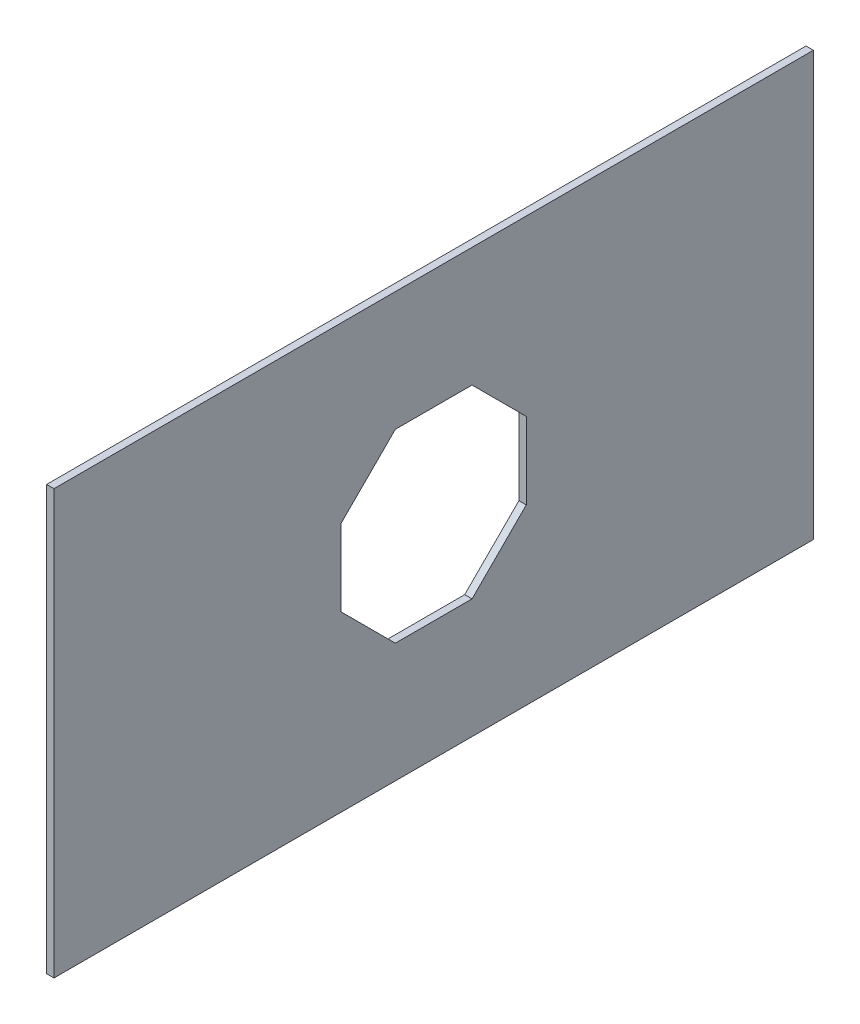
ISO-10303-21;
HEADER;
FILE_DESCRIPTION(('STEP AP214'),'2;1');
FILE_NAME('part.step','',(''),(''),'','','');
FILE_SCHEMA(('AUTOMOTIVE_DESIGN { 1 0 10303 214 1 1 1 1 }'));
ENDSEC;
DATA;
#1=APPLICATION_CONTEXT('core data for automotive mechanical design processes');
#2=APPLICATION_PROTOCOL_DEFINITION('international standard','automotive_design',2000,#1);
#3=PRODUCT_CONTEXT('',#1,'mechanical');
#4=PRODUCT('Part','Part','',(#3));
#5=PRODUCT_RELATED_PRODUCT_CATEGORY('part','',(#4));
#6=PRODUCT_DEFINITION_FORMATION('','',#4);
#7=PRODUCT_DEFINITION_CONTEXT('part definition',#1,'design');
#8=PRODUCT_DEFINITION('design','',#6,#7);
#9=PRODUCT_DEFINITION_SHAPE('','',#8);
#10=(LENGTH_UNIT() NAMED_UNIT(*) SI_UNIT(.MILLI.,.METRE.));
#11=(NAMED_UNIT(*) PLANE_ANGLE_UNIT() SI_UNIT($,.RADIAN.));
#12=(NAMED_UNIT(*) SI_UNIT($,.STERADIAN.) SOLID_ANGLE_UNIT());
#13=UNCERTAINTY_MEASURE_WITH_UNIT(LENGTH_MEASURE(1.E-05),#10,'distance_accuracy_value','');
#14=(GEOMETRIC_REPRESENTATION_CONTEXT(3) GLOBAL_UNCERTAINTY_ASSIGNED_CONTEXT((#13)) GLOBAL_UNIT_ASSIGNED_CONTEXT((#10,
#11,#12)) REPRESENTATION_CONTEXT('',''));
#15=CARTESIAN_POINT('',(0.,0.,0.));
#16=DIRECTION('',(0.,0.,1.));
#17=DIRECTION('',(1.,0.,0.));
#18=AXIS2_PLACEMENT_3D('',#15,#16,#17);
#19=CARTESIAN_POINT('',(4.7625,-137.31875,-246.0625));
#20=DIRECTION('',(0.,0.,1.));
#21=DIRECTION('',(1.,0.,0.));
#22=AXIS2_PLACEMENT_3D('',#19,#20,#21);
#23=PLANE('',#22);
#24=DIRECTION('',(0.,1.,0.));
#25=VECTOR('',#24,1.);
#26=CARTESIAN_POINT('',(0.,-137.31875,-246.0625));
#27=LINE('',#26,#25);
#28=CARTESIAN_POINT('',(0.,-137.31875,-246.0625));
#29=VERTEX_POINT('',#28);
#30=CARTESIAN_POINT('',(0.,137.31875,-246.0625));
#31=VERTEX_POINT('',#30);
#32=EDGE_CURVE('E127',#29,#31,#27,.T.);
#33=ORIENTED_EDGE('',*,*,#32,.T.);
#34=DIRECTION('',(-1.,0.,0.));
#35=VECTOR('',#34,1.);
#36=CARTESIAN_POINT('',(4.7625,137.31875,-246.0625));
#37=LINE('',#36,#35);
#38=CARTESIAN_POINT('',(4.7625,137.31875,-246.0625));
#39=VERTEX_POINT('',#38);
#40=EDGE_CURVE('E11',#39,#31,#37,.T.);
#41=ORIENTED_EDGE('',*,*,#40,.F.);
#42=DIRECTION('',(0.,1.,0.));
#43=VECTOR('',#42,1.);
#44=CARTESIAN_POINT('',(4.7625,-137.31875,-246.0625));
#45=LINE('',#44,#43);
#46=CARTESIAN_POINT('',(4.7625,-137.31875,-246.0625));
#47=VERTEX_POINT('',#46);
#48=EDGE_CURVE('E177',#47,#39,#45,.T.);
#49=ORIENTED_EDGE('',*,*,#48,.F.);
#50=DIRECTION('',(-1.,0.,0.));
#51=VECTOR('',#50,1.);
#52=CARTESIAN_POINT('',(4.7625,-137.31875,-246.0625));
#53=LINE('',#52,#51);
#54=EDGE_CURVE('E187',#47,#29,#53,.T.);
#55=ORIENTED_EDGE('',*,*,#54,.T.);
#56=EDGE_LOOP('',(#33,#41,#49,#55));
#57=FACE_BOUND('',#56,.T.);
#58=ADVANCED_FACE('F33',(#57),#23,.F.);
#59=CARTESIAN_POINT('',(4.7625,137.31875,246.0625));
#60=DIRECTION('',(0.,-1.,0.));
#61=DIRECTION('',(0.,0.,-1.));
#62=AXIS2_PLACEMENT_3D('',#59,#60,#61);
#63=PLANE('',#62);
#64=DIRECTION('',(0.,0.,1.));
#65=VECTOR('',#64,1.);
#66=CARTESIAN_POINT('',(0.,137.31875,246.0625));
#67=LINE('',#66,#65);
#68=CARTESIAN_POINT('',(0.,137.31875,246.0625));
#69=VERTEX_POINT('',#68);
#70=EDGE_CURVE('E190',#31,#69,#67,.T.);
#71=ORIENTED_EDGE('',*,*,#70,.T.);
#72=DIRECTION('',(-1.,0.,0.));
#73=VECTOR('',#72,1.);
#74=CARTESIAN_POINT('',(4.7625,137.31875,246.0625));
#75=LINE('',#74,#73);
#76=CARTESIAN_POINT('',(4.7625,137.31875,246.0625));
#77=VERTEX_POINT('',#76);
#78=EDGE_CURVE('E40',#77,#69,#75,.T.);
#79=ORIENTED_EDGE('',*,*,#78,.F.);
#80=DIRECTION('',(0.,0.,1.));
#81=VECTOR('',#80,1.);
#82=CARTESIAN_POINT('',(4.7625,137.31875,246.0625));
#83=LINE('',#82,#81);
#84=EDGE_CURVE('E180',#39,#77,#83,.T.);
#85=ORIENTED_EDGE('',*,*,#84,.F.);
#86=ORIENTED_EDGE('',*,*,#40,.T.);
#87=EDGE_LOOP('',(#71,#79,#85,#86));
#88=FACE_BOUND('',#87,.T.);
#89=ADVANCED_FACE('F218',(#88),#63,.F.);
#90=CARTESIAN_POINT('',(4.7625,-137.31875,246.0625));
#91=DIRECTION('',(0.,0.,-1.));
#92=DIRECTION('',(-1.,0.,0.));
#93=AXIS2_PLACEMENT_3D('',#90,#91,#92);
#94=PLANE('',#93);
#95=DIRECTION('',(0.,-1.,0.));
#96=VECTOR('',#95,1.);
#97=CARTESIAN_POINT('',(0.,-137.31875,246.0625));
#98=LINE('',#97,#96);
#99=CARTESIAN_POINT('',(0.,-137.31875,246.0625));
#100=VERTEX_POINT('',#99);
#101=EDGE_CURVE('E192',#69,#100,#98,.T.);
#102=ORIENTED_EDGE('',*,*,#101,.T.);
#103=DIRECTION('',(-1.,0.,0.));
#104=VECTOR('',#103,1.);
#105=CARTESIAN_POINT('',(4.7625,-137.31875,246.0625));
#106=LINE('',#105,#104);
#107=CARTESIAN_POINT('',(4.7625,-137.31875,246.0625));
#108=VERTEX_POINT('',#107);
#109=EDGE_CURVE('E197',#108,#100,#106,.T.);
#110=ORIENTED_EDGE('',*,*,#109,.F.);
#111=DIRECTION('',(0.,-1.,0.));
#112=VECTOR('',#111,1.);
#113=CARTESIAN_POINT('',(4.7625,-137.31875,246.0625));
#114=LINE('',#113,#112);
#115=EDGE_CURVE('E183',#77,#108,#114,.T.);
#116=ORIENTED_EDGE('',*,*,#115,.F.);
#117=ORIENTED_EDGE('',*,*,#78,.T.);
#118=EDGE_LOOP('',(#102,#110,#116,#117));
#119=FACE_BOUND('',#118,.T.);
#120=ADVANCED_FACE('F204',(#119),#94,.F.);
#121=CARTESIAN_POINT('',(4.7625,-137.31875,246.0625));
#122=DIRECTION('',(0.,1.,0.));
#123=DIRECTION('',(0.,0.,1.));
#124=AXIS2_PLACEMENT_3D('',#121,#122,#123);
#125=PLANE('',#124);
#126=DIRECTION('',(0.,0.,-1.));
#127=VECTOR('',#126,1.);
#128=CARTESIAN_POINT('',(0.,-137.31875,246.0625));
#129=LINE('',#128,#127);
#130=EDGE_CURVE('E181',#100,#29,#129,.T.);
#131=ORIENTED_EDGE('',*,*,#130,.T.);
#132=ORIENTED_EDGE('',*,*,#54,.F.);
#133=DIRECTION('',(0.,0.,-1.));
#134=VECTOR('',#133,1.);
#135=CARTESIAN_POINT('',(4.7625,-137.31875,246.0625));
#136=LINE('',#135,#134);
#137=EDGE_CURVE('E185',#108,#47,#136,.T.);
#138=ORIENTED_EDGE('',*,*,#137,.F.);
#139=ORIENTED_EDGE('',*,*,#109,.T.);
#140=EDGE_LOOP('',(#131,#132,#138,#139));
#141=FACE_BOUND('',#140,.T.);
#142=ADVANCED_FACE('F211',(#141),#125,.F.);
#143=CARTESIAN_POINT('',(4.7625,0.,0.));
#144=DIRECTION('',(-1.,0.,0.));
#145=DIRECTION('',(0.,0.,1.));
#146=AXIS2_PLACEMENT_3D('',#143,#144,#145);
#147=PLANE('',#146);
#148=DIRECTION('',(0.,0.707106781186546,-0.707106781186549));
#149=VECTOR('',#148,1.);
#150=CARTESIAN_POINT('',(4.7625,-42.4264068711929,-42.4264068711928));
#151=LINE('',#150,#149);
#152=CARTESIAN_POINT('',(4.7625,-60.,-24.8528137423857));
#153=VERTEX_POINT('',#152);
#154=CARTESIAN_POINT('',(4.7625,-24.8528137423858,-60.));
#155=VERTEX_POINT('',#154);
#156=EDGE_CURVE('E139',#153,#155,#151,.T.);
#157=ORIENTED_EDGE('',*,*,#156,.F.);
#158=DIRECTION('',(0.,0.,-1.));
#159=VECTOR('',#158,1.);
#160=CARTESIAN_POINT('',(4.7625,-60.,24.8528137423857));
#161=LINE('',#160,#159);
#162=CARTESIAN_POINT('',(4.7625,-60.,24.8528137423857));
#163=VERTEX_POINT('',#162);
#164=EDGE_CURVE('E47',#163,#153,#161,.T.);
#165=ORIENTED_EDGE('',*,*,#164,.F.);
#166=DIRECTION('',(0.,-0.707106781186546,-0.707106781186549));
#167=VECTOR('',#166,1.);
#168=CARTESIAN_POINT('',(4.7625,-24.8528137423858,60.));
#169=LINE('',#168,#167);
#170=CARTESIAN_POINT('',(4.7625,-24.8528137423858,60.));
#171=VERTEX_POINT('',#170);
#172=EDGE_CURVE('E161',#171,#163,#169,.T.);
#173=ORIENTED_EDGE('',*,*,#172,.F.);
#174=DIRECTION('',(0.,-1.,0.));
#175=VECTOR('',#174,1.);
#176=CARTESIAN_POINT('',(4.7625,-24.8528137423858,60.));
#177=LINE('',#176,#175);
#178=CARTESIAN_POINT('',(4.7625,24.8528137423856,60.));
#179=VERTEX_POINT('',#178);
#180=EDGE_CURVE('E158',#179,#171,#177,.T.);
#181=ORIENTED_EDGE('',*,*,#180,.F.);
#182=DIRECTION('',(0.,-0.707106781186549,0.707106781186546));
#183=VECTOR('',#182,1.);
#184=CARTESIAN_POINT('',(4.7625,60.,24.8528137423858));
#185=LINE('',#184,#183);
#186=CARTESIAN_POINT('',(4.7625,60.,24.8528137423858));
#187=VERTEX_POINT('',#186);
#188=EDGE_CURVE('E155',#187,#179,#185,.T.);
#189=ORIENTED_EDGE('',*,*,#188,.F.);
#190=DIRECTION('',(0.,0.,1.));
#191=VECTOR('',#190,1.);
#192=CARTESIAN_POINT('',(4.7625,60.,24.8528137423858));
#193=LINE('',#192,#191);
#194=CARTESIAN_POINT('',(4.7625,60.,-24.8528137423858));
#195=VERTEX_POINT('',#194);
#196=EDGE_CURVE('E152',#195,#187,#193,.T.);
#197=ORIENTED_EDGE('',*,*,#196,.F.);
#198=DIRECTION('',(0.,0.707106781186549,0.707106781186546));
#199=VECTOR('',#198,1.);
#200=CARTESIAN_POINT('',(4.7625,60.,-24.8528137423858));
#201=LINE('',#200,#199);
#202=CARTESIAN_POINT('',(4.7625,24.8528137423856,-60.));
#203=VERTEX_POINT('',#202);
#204=EDGE_CURVE('E149',#203,#195,#201,.T.);
#205=ORIENTED_EDGE('',*,*,#204,.F.);
#206=DIRECTION('',(0.,1.,0.));
#207=VECTOR('',#206,1.);
#208=CARTESIAN_POINT('',(4.7625,-24.8528137423858,-60.));
#209=LINE('',#208,#207);
#210=EDGE_CURVE('E141',#155,#203,#209,.T.);
#211=ORIENTED_EDGE('',*,*,#210,.F.);
#212=EDGE_LOOP('',(#157,#165,#173,#181,#189,#197,#205,#211));
#213=FACE_BOUND('',#212,.T.);
#214=ORIENTED_EDGE('',*,*,#48,.T.);
#215=ORIENTED_EDGE('',*,*,#84,.T.);
#216=ORIENTED_EDGE('',*,*,#115,.T.);
#217=ORIENTED_EDGE('',*,*,#137,.T.);
#218=EDGE_LOOP('',(#214,#215,#216,#217));
#219=FACE_BOUND('',#218,.T.);
#220=ADVANCED_FACE('F217',(#213,#219),#147,.F.);
#221=CARTESIAN_POINT('',(0.,0.,0.));
#222=DIRECTION('',(-1.,0.,0.));
#223=DIRECTION('',(0.,0.,1.));
#224=AXIS2_PLACEMENT_3D('',#221,#222,#223);
#225=PLANE('',#224);
#226=DIRECTION('',(0.,0.,-1.));
#227=VECTOR('',#226,1.);
#228=CARTESIAN_POINT('',(0.,-60.,24.8528137423857));
#229=LINE('',#228,#227);
#230=CARTESIAN_POINT('',(0.,-60.,24.8528137423857));
#231=VERTEX_POINT('',#230);
#232=CARTESIAN_POINT('',(0.,-60.,-24.8528137423856));
#233=VERTEX_POINT('',#232);
#234=EDGE_CURVE('E130',#231,#233,#229,.T.);
#235=ORIENTED_EDGE('',*,*,#234,.T.);
#236=DIRECTION('',(0.,0.707106781186546,-0.707106781186549));
#237=VECTOR('',#236,1.);
#238=CARTESIAN_POINT('',(0.,-42.4264068711929,-42.4264068711928));
#239=LINE('',#238,#237);
#240=CARTESIAN_POINT('',(0.,-24.8528137423858,-60.));
#241=VERTEX_POINT('',#240);
#242=EDGE_CURVE('E120',#233,#241,#239,.T.);
#243=ORIENTED_EDGE('',*,*,#242,.T.);
#244=DIRECTION('',(0.,1.,0.));
#245=VECTOR('',#244,1.);
#246=CARTESIAN_POINT('',(0.,-24.8528137423858,-60.));
#247=LINE('',#246,#245);
#248=CARTESIAN_POINT('',(0.,24.8528137423856,-60.));
#249=VERTEX_POINT('',#248);
#250=EDGE_CURVE('E354',#241,#249,#247,.T.);
#251=ORIENTED_EDGE('',*,*,#250,.T.);
#252=DIRECTION('',(0.,0.707106781186549,0.707106781186546));
#253=VECTOR('',#252,1.);
#254=CARTESIAN_POINT('',(0.,60.,-24.8528137423858));
#255=LINE('',#254,#253);
#256=CARTESIAN_POINT('',(0.,60.,-24.8528137423858));
#257=VERTEX_POINT('',#256);
#258=EDGE_CURVE('E356',#249,#257,#255,.T.);
#259=ORIENTED_EDGE('',*,*,#258,.T.);
#260=DIRECTION('',(0.,0.,1.));
#261=VECTOR('',#260,1.);
#262=CARTESIAN_POINT('',(0.,60.,24.8528137423858));
#263=LINE('',#262,#261);
#264=CARTESIAN_POINT('',(0.,60.,24.8528137423858));
#265=VERTEX_POINT('',#264);
#266=EDGE_CURVE('E358',#257,#265,#263,.T.);
#267=ORIENTED_EDGE('',*,*,#266,.T.);
#268=DIRECTION('',(0.,-0.707106781186549,0.707106781186546));
#269=VECTOR('',#268,1.);
#270=CARTESIAN_POINT('',(0.,60.,24.8528137423858));
#271=LINE('',#270,#269);
#272=CARTESIAN_POINT('',(0.,24.8528137423856,60.));
#273=VERTEX_POINT('',#272);
#274=EDGE_CURVE('E363',#265,#273,#271,.T.);
#275=ORIENTED_EDGE('',*,*,#274,.T.);
#276=DIRECTION('',(0.,-1.,0.));
#277=VECTOR('',#276,1.);
#278=CARTESIAN_POINT('',(0.,-24.8528137423858,60.));
#279=LINE('',#278,#277);
#280=CARTESIAN_POINT('',(0.,-24.8528137423858,60.));
#281=VERTEX_POINT('',#280);
#282=EDGE_CURVE('E143',#273,#281,#279,.T.);
#283=ORIENTED_EDGE('',*,*,#282,.T.);
#284=DIRECTION('',(0.,-0.707106781186546,-0.707106781186549));
#285=VECTOR('',#284,1.);
#286=CARTESIAN_POINT('',(0.,-24.8528137423858,60.));
#287=LINE('',#286,#285);
#288=EDGE_CURVE('E138',#281,#231,#287,.T.);
#289=ORIENTED_EDGE('',*,*,#288,.T.);
#290=EDGE_LOOP('',(#235,#243,#251,#259,#267,#275,#283,#289));
#291=FACE_BOUND('',#290,.T.);
#292=ORIENTED_EDGE('',*,*,#32,.F.);
#293=ORIENTED_EDGE('',*,*,#130,.F.);
#294=ORIENTED_EDGE('',*,*,#101,.F.);
#295=ORIENTED_EDGE('',*,*,#70,.F.);
#296=EDGE_LOOP('',(#292,#293,#294,#295));
#297=FACE_BOUND('',#296,.T.);
#298=ADVANCED_FACE('F135',(#291,#297),#225,.T.);
#299=CARTESIAN_POINT('',(-0.00100000000000013,-60.,24.8528137423857));
#300=DIRECTION('',(0.,-1.,0.));
#301=DIRECTION('',(0.,0.,-1.));
#302=AXIS2_PLACEMENT_3D('',#299,#300,#301);
#303=PLANE('',#302);
#304=DIRECTION('',(1.,0.,0.));
#305=VECTOR('',#304,1.);
#306=CARTESIAN_POINT('',(-0.00100000000000013,-60.,24.8528137423857));
#307=LINE('',#306,#305);
#308=EDGE_CURVE('E132',#231,#163,#307,.T.);
#309=ORIENTED_EDGE('',*,*,#308,.T.);
#310=ORIENTED_EDGE('',*,*,#164,.T.);
#311=DIRECTION('',(1.,0.,0.));
#312=VECTOR('',#311,1.);
#313=CARTESIAN_POINT('',(-0.00100000000000013,-60.,-24.8528137423857));
#314=LINE('',#313,#312);
#315=EDGE_CURVE('E122',#233,#153,#314,.T.);
#316=ORIENTED_EDGE('',*,*,#315,.F.);
#317=ORIENTED_EDGE('',*,*,#234,.F.);
#318=EDGE_LOOP('',(#309,#310,#316,#317));
#319=FACE_BOUND('',#318,.T.);
#320=ADVANCED_FACE('F129',(#319),#303,.F.);
#321=CARTESIAN_POINT('',(-0.00100000000000013,-24.8528137423858,60.));
#322=DIRECTION('',(0.,-0.707106781186549,0.707106781186546));
#323=DIRECTION('',(0.,-0.707106781186546,-0.707106781186549));
#324=AXIS2_PLACEMENT_3D('',#321,#322,#323);
#325=PLANE('',#324);
#326=DIRECTION('',(1.,0.,0.));
#327=VECTOR('',#326,1.);
#328=CARTESIAN_POINT('',(-0.00100000000000013,-24.8528137423858,60.));
#329=LINE('',#328,#327);
#330=EDGE_CURVE('E166',#281,#171,#329,.T.);
#331=ORIENTED_EDGE('',*,*,#330,.T.);
#332=ORIENTED_EDGE('',*,*,#172,.T.);
#333=ORIENTED_EDGE('',*,*,#308,.F.);
#334=ORIENTED_EDGE('',*,*,#288,.F.);
#335=EDGE_LOOP('',(#331,#332,#333,#334));
#336=FACE_BOUND('',#335,.T.);
#337=ADVANCED_FACE('F254',(#336),#325,.F.);
#338=CARTESIAN_POINT('',(-0.00100000000000013,-24.8528137423858,60.));
#339=DIRECTION('',(0.,0.,1.));
#340=DIRECTION('',(0.,-1.,0.));
#341=AXIS2_PLACEMENT_3D('',#338,#339,#340);
#342=PLANE('',#341);
#343=DIRECTION('',(1.,0.,0.));
#344=VECTOR('',#343,1.);
#345=CARTESIAN_POINT('',(-0.00100000000000013,24.8528137423856,60.));
#346=LINE('',#345,#344);
#347=EDGE_CURVE('E168',#273,#179,#346,.T.);
#348=ORIENTED_EDGE('',*,*,#347,.T.);
#349=ORIENTED_EDGE('',*,*,#180,.T.);
#350=ORIENTED_EDGE('',*,*,#330,.F.);
#351=ORIENTED_EDGE('',*,*,#282,.F.);
#352=EDGE_LOOP('',(#348,#349,#350,#351));
#353=FACE_BOUND('',#352,.T.);
#354=ADVANCED_FACE('F250',(#353),#342,.F.);
#355=CARTESIAN_POINT('',(-0.00100000000000013,60.,24.8528137423858));
#356=DIRECTION('',(0.,0.707106781186546,0.707106781186549));
#357=DIRECTION('',(0.,-0.707106781186549,0.707106781186546));
#358=AXIS2_PLACEMENT_3D('',#355,#356,#357);
#359=PLANE('',#358);
#360=DIRECTION('',(1.,0.,0.));
#361=VECTOR('',#360,1.);
#362=CARTESIAN_POINT('',(-0.00100000000000013,60.,24.8528137423858));
#363=LINE('',#362,#361);
#364=EDGE_CURVE('E170',#265,#187,#363,.T.);
#365=ORIENTED_EDGE('',*,*,#364,.T.);
#366=ORIENTED_EDGE('',*,*,#188,.T.);
#367=ORIENTED_EDGE('',*,*,#347,.F.);
#368=ORIENTED_EDGE('',*,*,#274,.F.);
#369=EDGE_LOOP('',(#365,#366,#367,#368));
#370=FACE_BOUND('',#369,.T.);
#371=ADVANCED_FACE('F246',(#370),#359,.F.);
#372=CARTESIAN_POINT('',(-0.00100000000000013,60.,24.8528137423858));
#373=DIRECTION('',(0.,1.,0.));
#374=DIRECTION('',(0.,0.,1.));
#375=AXIS2_PLACEMENT_3D('',#372,#373,#374);
#376=PLANE('',#375);
#377=DIRECTION('',(1.,0.,0.));
#378=VECTOR('',#377,1.);
#379=CARTESIAN_POINT('',(-0.00100000000000013,60.,-24.8528137423858));
#380=LINE('',#379,#378);
#381=EDGE_CURVE('E172',#257,#195,#380,.T.);
#382=ORIENTED_EDGE('',*,*,#381,.T.);
#383=ORIENTED_EDGE('',*,*,#196,.T.);
#384=ORIENTED_EDGE('',*,*,#364,.F.);
#385=ORIENTED_EDGE('',*,*,#266,.F.);
#386=EDGE_LOOP('',(#382,#383,#384,#385));
#387=FACE_BOUND('',#386,.T.);
#388=ADVANCED_FACE('F242',(#387),#376,.F.);
#389=CARTESIAN_POINT('',(-0.00100000000000013,60.,-24.8528137423858));
#390=DIRECTION('',(0.,0.707106781186546,-0.707106781186549));
#391=DIRECTION('',(0.,0.707106781186549,0.707106781186546));
#392=AXIS2_PLACEMENT_3D('',#389,#390,#391);
#393=PLANE('',#392);
#394=DIRECTION('',(1.,0.,0.));
#395=VECTOR('',#394,1.);
#396=CARTESIAN_POINT('',(-0.00100000000000013,24.8528137423856,-60.));
#397=LINE('',#396,#395);
#398=EDGE_CURVE('E174',#249,#203,#397,.T.);
#399=ORIENTED_EDGE('',*,*,#398,.T.);
#400=ORIENTED_EDGE('',*,*,#204,.T.);
#401=ORIENTED_EDGE('',*,*,#381,.F.);
#402=ORIENTED_EDGE('',*,*,#258,.F.);
#403=EDGE_LOOP('',(#399,#400,#401,#402));
#404=FACE_BOUND('',#403,.T.);
#405=ADVANCED_FACE('F238',(#404),#393,.F.);
#406=CARTESIAN_POINT('',(-0.00100000000000013,-24.8528137423858,-60.));
#407=DIRECTION('',(0.,0.,-1.));
#408=DIRECTION('',(0.,1.,0.));
#409=AXIS2_PLACEMENT_3D('',#406,#407,#408);
#410=PLANE('',#409);
#411=DIRECTION('',(1.,0.,0.));
#412=VECTOR('',#411,1.);
#413=CARTESIAN_POINT('',(-0.00100000000000013,-24.8528137423858,-60.));
#414=LINE('',#413,#412);
#415=EDGE_CURVE('E55',#241,#155,#414,.T.);
#416=ORIENTED_EDGE('',*,*,#415,.T.);
#417=ORIENTED_EDGE('',*,*,#210,.T.);
#418=ORIENTED_EDGE('',*,*,#398,.F.);
#419=ORIENTED_EDGE('',*,*,#250,.F.);
#420=EDGE_LOOP('',(#416,#417,#418,#419));
#421=FACE_BOUND('',#420,.T.);
#422=ADVANCED_FACE('F235',(#421),#410,.F.);
#423=CARTESIAN_POINT('',(-0.00100000000000013,-42.4264068711929,-42.4264068711928));
#424=DIRECTION('',(0.,-0.707106781186549,-0.707106781186546));
#425=DIRECTION('',(0.,0.707106781186546,-0.707106781186549));
#426=AXIS2_PLACEMENT_3D('',#423,#424,#425);
#427=PLANE('',#426);
#428=ORIENTED_EDGE('',*,*,#315,.T.);
#429=ORIENTED_EDGE('',*,*,#156,.T.);
#430=ORIENTED_EDGE('',*,*,#415,.F.);
#431=ORIENTED_EDGE('',*,*,#242,.F.);
#432=EDGE_LOOP('',(#428,#429,#430,#431));
#433=FACE_BOUND('',#432,.T.);
#434=ADVANCED_FACE('F121',(#433),#427,.F.);
#435=CLOSED_SHELL('',(#58,#89,#120,#142,#220,#298,#320,#337,#354,#371,#388,#405,#422,#434));
#436=MANIFOLD_SOLID_BREP('B2',#435);
#437=ADVANCED_BREP_SHAPE_REPRESENTATION('',(#18,#436),#14);
#438=SHAPE_DEFINITION_REPRESENTATION(#9,#437);
ENDSEC;
END-ISO-10303-21;
